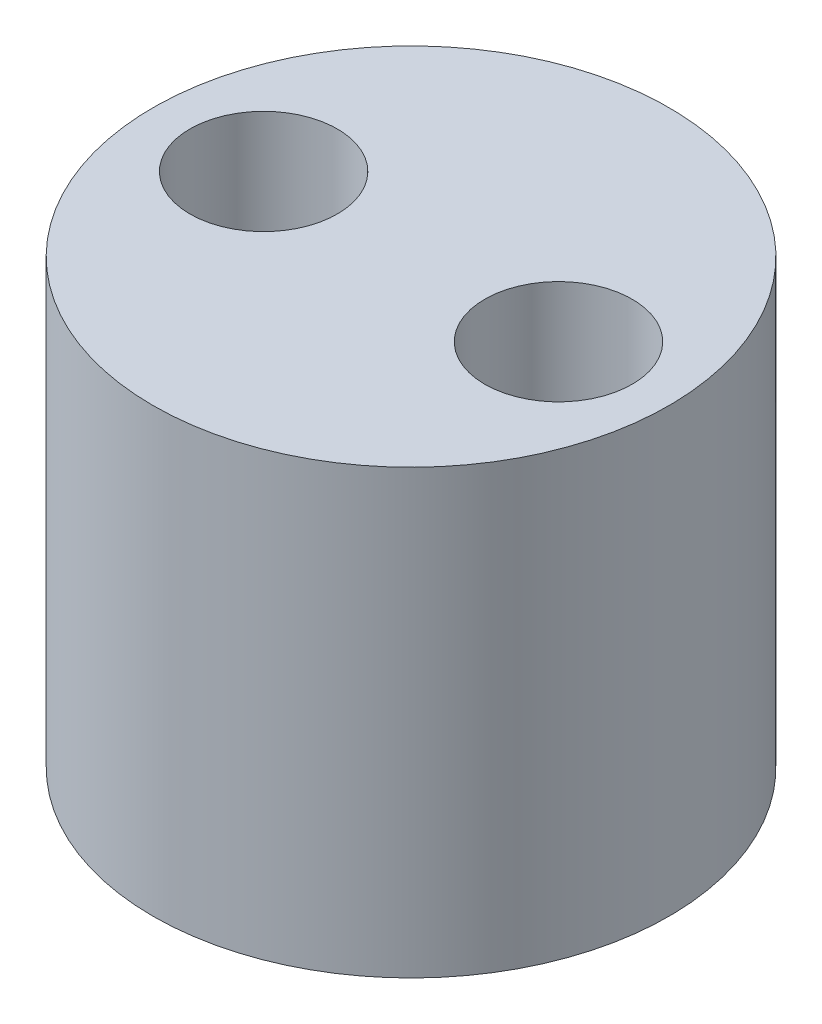
ISO-10303-21;
HEADER;
FILE_DESCRIPTION(('STEP AP214'),'2;1');
FILE_NAME('part.step','',(''),(''),'','','');
FILE_SCHEMA(('AUTOMOTIVE_DESIGN { 1 0 10303 214 1 1 1 1 }'));
ENDSEC;
DATA;
#1=APPLICATION_CONTEXT('core data for automotive mechanical design processes');
#2=APPLICATION_PROTOCOL_DEFINITION('international standard','automotive_design',2000,#1);
#3=PRODUCT_CONTEXT('',#1,'mechanical');
#4=PRODUCT('Part','Part','',(#3));
#5=PRODUCT_RELATED_PRODUCT_CATEGORY('part','',(#4));
#6=PRODUCT_DEFINITION_FORMATION('','',#4);
#7=PRODUCT_DEFINITION_CONTEXT('part definition',#1,'design');
#8=PRODUCT_DEFINITION('design','',#6,#7);
#9=PRODUCT_DEFINITION_SHAPE('','',#8);
#10=(LENGTH_UNIT() NAMED_UNIT(*) SI_UNIT(.MILLI.,.METRE.));
#11=(NAMED_UNIT(*) PLANE_ANGLE_UNIT() SI_UNIT($,.RADIAN.));
#12=(NAMED_UNIT(*) SI_UNIT($,.STERADIAN.) SOLID_ANGLE_UNIT());
#13=UNCERTAINTY_MEASURE_WITH_UNIT(LENGTH_MEASURE(1.E-05),#10,'distance_accuracy_value','');
#14=(GEOMETRIC_REPRESENTATION_CONTEXT(3) GLOBAL_UNCERTAINTY_ASSIGNED_CONTEXT((#13)) GLOBAL_UNIT_ASSIGNED_CONTEXT((#10,
#11,#12)) REPRESENTATION_CONTEXT('',''));
#15=CARTESIAN_POINT('',(0.,0.,0.));
#16=DIRECTION('',(0.,0.,1.));
#17=DIRECTION('',(1.,0.,0.));
#18=AXIS2_PLACEMENT_3D('',#15,#16,#17);
#19=CARTESIAN_POINT('',(0.,76.2,0.));
#20=DIRECTION('',(0.,1.,0.));
#21=DIRECTION('',(0.,0.,1.));
#22=AXIS2_PLACEMENT_3D('',#19,#20,#21);
#23=PLANE('',#22);
#24=CARTESIAN_POINT('',(25.4,76.2,0.));
#25=DIRECTION('',(0.,1.,0.));
#26=DIRECTION('',(0.,0.,1.));
#27=AXIS2_PLACEMENT_3D('',#24,#25,#26);
#28=CIRCLE('',#27,12.7);
#29=CARTESIAN_POINT('',(25.4,76.2,12.7));
#30=VERTEX_POINT('',#29);
#31=EDGE_CURVE('E62',#30,#30,#28,.T.);
#32=ORIENTED_EDGE('',*,*,#31,.F.);
#33=EDGE_LOOP('',(#32));
#34=FACE_BOUND('',#33,.T.);
#35=CARTESIAN_POINT('',(0.,76.2,0.));
#36=DIRECTION('',(0.,1.,0.));
#37=DIRECTION('',(0.,0.,1.));
#38=AXIS2_PLACEMENT_3D('',#35,#36,#37);
#39=CIRCLE('',#38,44.45);
#40=CARTESIAN_POINT('',(0.,76.2,44.45));
#41=VERTEX_POINT('',#40);
#42=EDGE_CURVE('E11',#41,#41,#39,.T.);
#43=ORIENTED_EDGE('',*,*,#42,.T.);
#44=EDGE_LOOP('',(#43));
#45=FACE_BOUND('',#44,.T.);
#46=CARTESIAN_POINT('',(-25.4,76.2,0.));
#47=DIRECTION('',(0.,1.,0.));
#48=DIRECTION('',(0.,0.,1.));
#49=AXIS2_PLACEMENT_3D('',#46,#47,#48);
#50=CIRCLE('',#49,12.7);
#51=CARTESIAN_POINT('',(-25.4,76.2,12.7));
#52=VERTEX_POINT('',#51);
#53=EDGE_CURVE('E68',#52,#52,#50,.T.);
#54=ORIENTED_EDGE('',*,*,#53,.F.);
#55=EDGE_LOOP('',(#54));
#56=FACE_BOUND('',#55,.T.);
#57=ADVANCED_FACE('F49',(#34,#45,#56),#23,.T.);
#58=CARTESIAN_POINT('',(0.,0.,0.));
#59=DIRECTION('',(0.,1.,0.));
#60=DIRECTION('',(0.,0.,1.));
#61=AXIS2_PLACEMENT_3D('',#58,#59,#60);
#62=PLANE('',#61);
#63=CARTESIAN_POINT('',(0.,0.,0.));
#64=DIRECTION('',(0.,1.,0.));
#65=DIRECTION('',(0.,0.,1.));
#66=AXIS2_PLACEMENT_3D('',#63,#64,#65);
#67=CIRCLE('',#66,44.45);
#68=CARTESIAN_POINT('',(0.,0.,44.45));
#69=VERTEX_POINT('',#68);
#70=EDGE_CURVE('E53',#69,#69,#67,.T.);
#71=ORIENTED_EDGE('',*,*,#70,.F.);
#72=EDGE_LOOP('',(#71));
#73=FACE_BOUND('',#72,.T.);
#74=CARTESIAN_POINT('',(25.4,0.,0.));
#75=DIRECTION('',(0.,1.,0.));
#76=DIRECTION('',(0.,0.,1.));
#77=AXIS2_PLACEMENT_3D('',#74,#75,#76);
#78=CIRCLE('',#77,12.7);
#79=CARTESIAN_POINT('',(25.4,0.,12.7));
#80=VERTEX_POINT('',#79);
#81=EDGE_CURVE('E64',#80,#80,#78,.T.);
#82=ORIENTED_EDGE('',*,*,#81,.T.);
#83=EDGE_LOOP('',(#82));
#84=FACE_BOUND('',#83,.T.);
#85=CARTESIAN_POINT('',(-25.4,0.,0.));
#86=DIRECTION('',(0.,1.,0.));
#87=DIRECTION('',(0.,0.,1.));
#88=AXIS2_PLACEMENT_3D('',#85,#86,#87);
#89=CIRCLE('',#88,12.7);
#90=CARTESIAN_POINT('',(-25.4,0.,12.7));
#91=VERTEX_POINT('',#90);
#92=EDGE_CURVE('E72',#91,#91,#89,.T.);
#93=ORIENTED_EDGE('',*,*,#92,.T.);
#94=EDGE_LOOP('',(#93));
#95=FACE_BOUND('',#94,.T.);
#96=ADVANCED_FACE('F84',(#73,#84,#95),#62,.F.);
#97=CARTESIAN_POINT('',(0.,76.2,0.));
#98=DIRECTION('',(0.,-1.,0.));
#99=DIRECTION('',(0.,0.,-1.));
#100=AXIS2_PLACEMENT_3D('',#97,#98,#99);
#101=CYLINDRICAL_SURFACE('',#100,44.45);
#102=ORIENTED_EDGE('',*,*,#42,.F.);
#103=EDGE_LOOP('',(#102));
#104=FACE_BOUND('',#103,.T.);
#105=ORIENTED_EDGE('',*,*,#70,.T.);
#106=EDGE_LOOP('',(#105));
#107=FACE_BOUND('',#106,.T.);
#108=ADVANCED_FACE('F51',(#104,#107),#101,.T.);
#109=CARTESIAN_POINT('',(25.4,76.2,0.));
#110=DIRECTION('',(0.,-1.,0.));
#111=DIRECTION('',(0.,0.,-1.));
#112=AXIS2_PLACEMENT_3D('',#109,#110,#111);
#113=CYLINDRICAL_SURFACE('',#112,12.7);
#114=ORIENTED_EDGE('',*,*,#31,.T.);
#115=EDGE_LOOP('',(#114));
#116=FACE_BOUND('',#115,.T.);
#117=ORIENTED_EDGE('',*,*,#81,.F.);
#118=EDGE_LOOP('',(#117));
#119=FACE_BOUND('',#118,.T.);
#120=ADVANCED_FACE('F93',(#116,#119),#113,.F.);
#121=CARTESIAN_POINT('',(-25.4,76.2,0.));
#122=DIRECTION('',(0.,-1.,0.));
#123=DIRECTION('',(0.,0.,-1.));
#124=AXIS2_PLACEMENT_3D('',#121,#122,#123);
#125=CYLINDRICAL_SURFACE('',#124,12.7);
#126=ORIENTED_EDGE('',*,*,#53,.T.);
#127=EDGE_LOOP('',(#126));
#128=FACE_BOUND('',#127,.T.);
#129=ORIENTED_EDGE('',*,*,#92,.F.);
#130=EDGE_LOOP('',(#129));
#131=FACE_BOUND('',#130,.T.);
#132=ADVANCED_FACE('F80',(#128,#131),#125,.F.);
#133=CLOSED_SHELL('',(#57,#96,#108,#120,#132));
#134=MANIFOLD_SOLID_BREP('B2',#133);
#135=ADVANCED_BREP_SHAPE_REPRESENTATION('',(#18,#134),#14);
#136=SHAPE_DEFINITION_REPRESENTATION(#9,#135);
ENDSEC;
END-ISO-10303-21;
